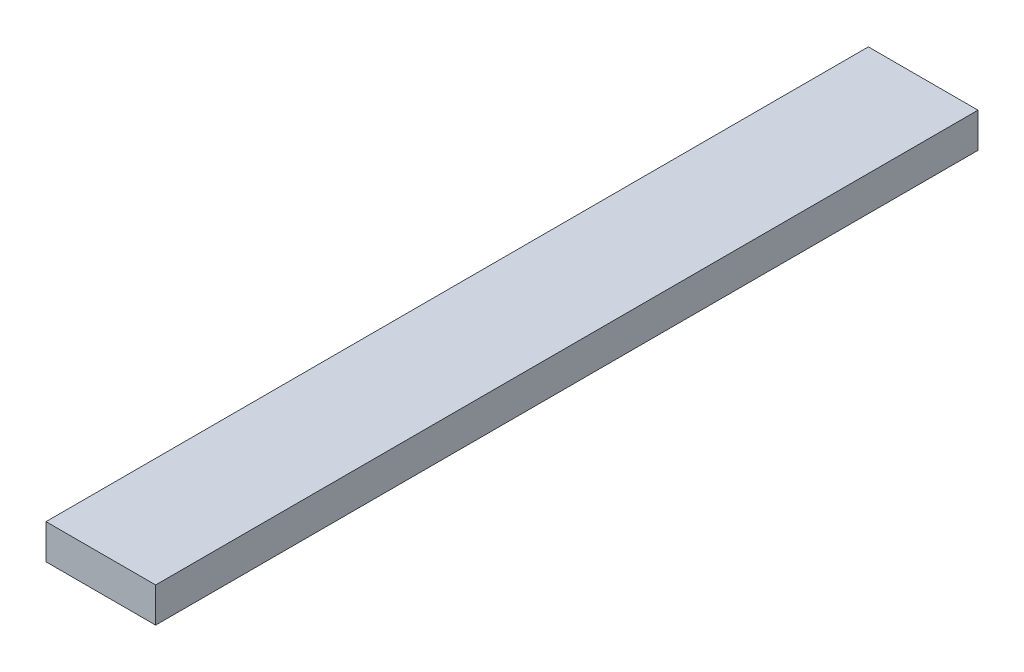
ISO-10303-21;
HEADER;
FILE_DESCRIPTION(('STEP AP214'),'2;1');
FILE_NAME('part.step','',(''),(''),'','','');
FILE_SCHEMA(('AUTOMOTIVE_DESIGN { 1 0 10303 214 1 1 1 1 }'));
ENDSEC;
DATA;
#1=APPLICATION_CONTEXT('core data for automotive mechanical design processes');
#2=APPLICATION_PROTOCOL_DEFINITION('international standard','automotive_design',2000,#1);
#3=PRODUCT_CONTEXT('',#1,'mechanical');
#4=PRODUCT('Part','Part','',(#3));
#5=PRODUCT_RELATED_PRODUCT_CATEGORY('part','',(#4));
#6=PRODUCT_DEFINITION_FORMATION('','',#4);
#7=PRODUCT_DEFINITION_CONTEXT('part definition',#1,'design');
#8=PRODUCT_DEFINITION('design','',#6,#7);
#9=PRODUCT_DEFINITION_SHAPE('','',#8);
#10=(LENGTH_UNIT() NAMED_UNIT(*) SI_UNIT(.MILLI.,.METRE.));
#11=(NAMED_UNIT(*) PLANE_ANGLE_UNIT() SI_UNIT($,.RADIAN.));
#12=(NAMED_UNIT(*) SI_UNIT($,.STERADIAN.) SOLID_ANGLE_UNIT());
#13=UNCERTAINTY_MEASURE_WITH_UNIT(LENGTH_MEASURE(1.E-05),#10,'distance_accuracy_value','');
#14=(GEOMETRIC_REPRESENTATION_CONTEXT(3) GLOBAL_UNCERTAINTY_ASSIGNED_CONTEXT((#13)) GLOBAL_UNIT_ASSIGNED_CONTEXT((#10,
#11,#12)) REPRESENTATION_CONTEXT('',''));
#15=CARTESIAN_POINT('',(0.,0.,0.));
#16=DIRECTION('',(0.,0.,1.));
#17=DIRECTION('',(1.,0.,0.));
#18=AXIS2_PLACEMENT_3D('',#15,#16,#17);
#19=CARTESIAN_POINT('',(0.,6.35,-150.));
#20=DIRECTION('',(1.,0.,0.));
#21=DIRECTION('',(0.,0.,-1.));
#22=AXIS2_PLACEMENT_3D('',#19,#20,#21);
#23=PLANE('',#22);
#24=DIRECTION('',(0.,0.,1.));
#25=VECTOR('',#24,1.);
#26=CARTESIAN_POINT('',(0.,0.,-150.));
#27=LINE('',#26,#25);
#28=CARTESIAN_POINT('',(0.,0.,-150.));
#29=VERTEX_POINT('',#28);
#30=CARTESIAN_POINT('',(0.,0.,0.));
#31=VERTEX_POINT('',#30);
#32=EDGE_CURVE('E113',#29,#31,#27,.T.);
#33=ORIENTED_EDGE('',*,*,#32,.T.);
#34=DIRECTION('',(0.,-1.,0.));
#35=VECTOR('',#34,1.);
#36=CARTESIAN_POINT('',(0.,6.35,0.));
#37=LINE('',#36,#35);
#38=CARTESIAN_POINT('',(0.,6.35,0.));
#39=VERTEX_POINT('',#38);
#40=EDGE_CURVE('E11',#39,#31,#37,.T.);
#41=ORIENTED_EDGE('',*,*,#40,.F.);
#42=DIRECTION('',(0.,0.,1.));
#43=VECTOR('',#42,1.);
#44=CARTESIAN_POINT('',(0.,6.35,-150.));
#45=LINE('',#44,#43);
#46=CARTESIAN_POINT('',(0.,6.35,-150.));
#47=VERTEX_POINT('',#46);
#48=EDGE_CURVE('E97',#47,#39,#45,.T.);
#49=ORIENTED_EDGE('',*,*,#48,.F.);
#50=DIRECTION('',(0.,-1.,0.));
#51=VECTOR('',#50,1.);
#52=CARTESIAN_POINT('',(0.,6.35,-150.));
#53=LINE('',#52,#51);
#54=EDGE_CURVE('E109',#47,#29,#53,.T.);
#55=ORIENTED_EDGE('',*,*,#54,.T.);
#56=EDGE_LOOP('',(#33,#41,#49,#55));
#57=FACE_BOUND('',#56,.T.);
#58=ADVANCED_FACE('F45',(#57),#23,.F.);
#59=CARTESIAN_POINT('',(0.,6.35,0.));
#60=DIRECTION('',(0.,0.,-1.));
#61=DIRECTION('',(-1.,0.,0.));
#62=AXIS2_PLACEMENT_3D('',#59,#60,#61);
#63=PLANE('',#62);
#64=DIRECTION('',(1.,0.,0.));
#65=VECTOR('',#64,1.);
#66=CARTESIAN_POINT('',(0.,0.,0.));
#67=LINE('',#66,#65);
#68=CARTESIAN_POINT('',(20.,0.,0.));
#69=VERTEX_POINT('',#68);
#70=EDGE_CURVE('E102',#31,#69,#67,.T.);
#71=ORIENTED_EDGE('',*,*,#70,.T.);
#72=DIRECTION('',(0.,-1.,0.));
#73=VECTOR('',#72,1.);
#74=CARTESIAN_POINT('',(20.,6.35,0.));
#75=LINE('',#74,#73);
#76=CARTESIAN_POINT('',(20.,6.35,0.));
#77=VERTEX_POINT('',#76);
#78=EDGE_CURVE('E54',#77,#69,#75,.T.);
#79=ORIENTED_EDGE('',*,*,#78,.F.);
#80=DIRECTION('',(1.,0.,0.));
#81=VECTOR('',#80,1.);
#82=CARTESIAN_POINT('',(0.,6.35,0.));
#83=LINE('',#82,#81);
#84=EDGE_CURVE('E92',#39,#77,#83,.T.);
#85=ORIENTED_EDGE('',*,*,#84,.F.);
#86=ORIENTED_EDGE('',*,*,#40,.T.);
#87=EDGE_LOOP('',(#71,#79,#85,#86));
#88=FACE_BOUND('',#87,.T.);
#89=ADVANCED_FACE('F101',(#88),#63,.F.);
#90=CARTESIAN_POINT('',(20.,6.35,-150.));
#91=DIRECTION('',(-1.,0.,0.));
#92=DIRECTION('',(0.,0.,1.));
#93=AXIS2_PLACEMENT_3D('',#90,#91,#92);
#94=PLANE('',#93);
#95=DIRECTION('',(0.,0.,-1.));
#96=VECTOR('',#95,1.);
#97=CARTESIAN_POINT('',(20.,0.,-150.));
#98=LINE('',#97,#96);
#99=CARTESIAN_POINT('',(20.,0.,-150.));
#100=VERTEX_POINT('',#99);
#101=EDGE_CURVE('E79',#69,#100,#98,.T.);
#102=ORIENTED_EDGE('',*,*,#101,.T.);
#103=DIRECTION('',(0.,-1.,0.));
#104=VECTOR('',#103,1.);
#105=CARTESIAN_POINT('',(20.,6.35,-150.));
#106=LINE('',#105,#104);
#107=CARTESIAN_POINT('',(20.,6.35,-150.));
#108=VERTEX_POINT('',#107);
#109=EDGE_CURVE('E104',#108,#100,#106,.T.);
#110=ORIENTED_EDGE('',*,*,#109,.F.);
#111=DIRECTION('',(0.,0.,-1.));
#112=VECTOR('',#111,1.);
#113=CARTESIAN_POINT('',(20.,6.35,-150.));
#114=LINE('',#113,#112);
#115=EDGE_CURVE('E95',#77,#108,#114,.T.);
#116=ORIENTED_EDGE('',*,*,#115,.F.);
#117=ORIENTED_EDGE('',*,*,#78,.T.);
#118=EDGE_LOOP('',(#102,#110,#116,#117));
#119=FACE_BOUND('',#118,.T.);
#120=ADVANCED_FACE('F105',(#119),#94,.F.);
#121=CARTESIAN_POINT('',(0.,6.35,-150.));
#122=DIRECTION('',(0.,0.,1.));
#123=DIRECTION('',(1.,0.,0.));
#124=AXIS2_PLACEMENT_3D('',#121,#122,#123);
#125=PLANE('',#124);
#126=DIRECTION('',(-1.,0.,0.));
#127=VECTOR('',#126,1.);
#128=CARTESIAN_POINT('',(0.,0.,-150.));
#129=LINE('',#128,#127);
#130=EDGE_CURVE('E85',#100,#29,#129,.T.);
#131=ORIENTED_EDGE('',*,*,#130,.T.);
#132=ORIENTED_EDGE('',*,*,#54,.F.);
#133=DIRECTION('',(-1.,0.,0.));
#134=VECTOR('',#133,1.);
#135=CARTESIAN_POINT('',(0.,6.35,-150.));
#136=LINE('',#135,#134);
#137=EDGE_CURVE('E62',#108,#47,#136,.T.);
#138=ORIENTED_EDGE('',*,*,#137,.F.);
#139=ORIENTED_EDGE('',*,*,#109,.T.);
#140=EDGE_LOOP('',(#131,#132,#138,#139));
#141=FACE_BOUND('',#140,.T.);
#142=ADVANCED_FACE('F126',(#141),#125,.F.);
#143=CARTESIAN_POINT('',(0.,6.35,0.));
#144=DIRECTION('',(0.,1.,0.));
#145=DIRECTION('',(0.,0.,1.));
#146=AXIS2_PLACEMENT_3D('',#143,#144,#145);
#147=PLANE('',#146);
#148=ORIENTED_EDGE('',*,*,#48,.T.);
#149=ORIENTED_EDGE('',*,*,#84,.T.);
#150=ORIENTED_EDGE('',*,*,#115,.T.);
#151=ORIENTED_EDGE('',*,*,#137,.T.);
#152=EDGE_LOOP('',(#148,#149,#150,#151));
#153=FACE_BOUND('',#152,.T.);
#154=ADVANCED_FACE('F93',(#153),#147,.T.);
#155=CARTESIAN_POINT('',(0.,0.,0.));
#156=DIRECTION('',(0.,1.,0.));
#157=DIRECTION('',(0.,0.,1.));
#158=AXIS2_PLACEMENT_3D('',#155,#156,#157);
#159=PLANE('',#158);
#160=ORIENTED_EDGE('',*,*,#32,.F.);
#161=ORIENTED_EDGE('',*,*,#130,.F.);
#162=ORIENTED_EDGE('',*,*,#101,.F.);
#163=ORIENTED_EDGE('',*,*,#70,.F.);
#164=EDGE_LOOP('',(#160,#161,#162,#163));
#165=FACE_BOUND('',#164,.T.);
#166=ADVANCED_FACE('F129',(#165),#159,.F.);
#167=CLOSED_SHELL('',(#58,#89,#120,#142,#154,#166));
#168=MANIFOLD_SOLID_BREP('B2',#167);
#169=ADVANCED_BREP_SHAPE_REPRESENTATION('',(#18,#168),#14);
#170=SHAPE_DEFINITION_REPRESENTATION(#9,#169);
ENDSEC;
END-ISO-10303-21;
